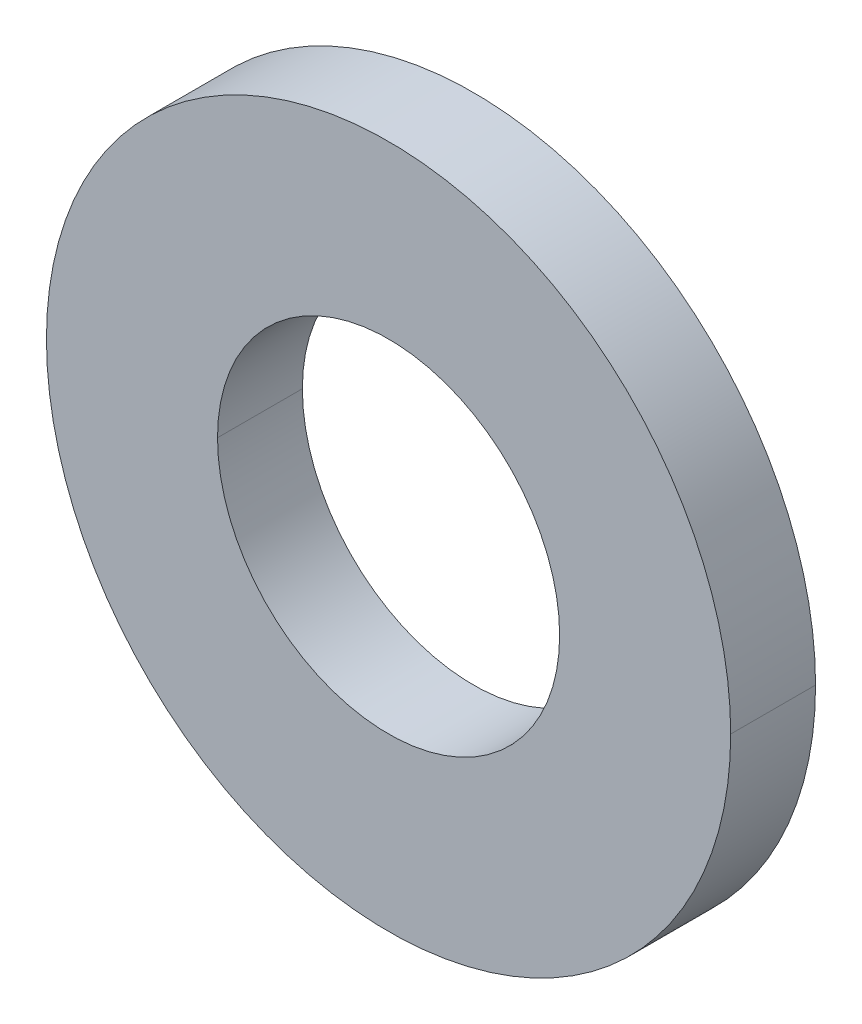
ISO-10303-21;
HEADER;
FILE_DESCRIPTION(('STEP AP214'),'2;1');
FILE_NAME('part.step','',(''),(''),'','','');
FILE_SCHEMA(('AUTOMOTIVE_DESIGN { 1 0 10303 214 1 1 1 1 }'));
ENDSEC;
DATA;
#1=APPLICATION_CONTEXT('core data for automotive mechanical design processes');
#2=APPLICATION_PROTOCOL_DEFINITION('international standard','automotive_design',2000,#1);
#3=PRODUCT_CONTEXT('',#1,'mechanical');
#4=PRODUCT('Part','Part','',(#3));
#5=PRODUCT_RELATED_PRODUCT_CATEGORY('part','',(#4));
#6=PRODUCT_DEFINITION_FORMATION('','',#4);
#7=PRODUCT_DEFINITION_CONTEXT('part definition',#1,'design');
#8=PRODUCT_DEFINITION('design','',#6,#7);
#9=PRODUCT_DEFINITION_SHAPE('','',#8);
#10=(LENGTH_UNIT() NAMED_UNIT(*) SI_UNIT(.MILLI.,.METRE.));
#11=(NAMED_UNIT(*) PLANE_ANGLE_UNIT() SI_UNIT($,.RADIAN.));
#12=(NAMED_UNIT(*) SI_UNIT($,.STERADIAN.) SOLID_ANGLE_UNIT());
#13=UNCERTAINTY_MEASURE_WITH_UNIT(LENGTH_MEASURE(1.E-05),#10,'distance_accuracy_value','');
#14=(GEOMETRIC_REPRESENTATION_CONTEXT(3) GLOBAL_UNCERTAINTY_ASSIGNED_CONTEXT((#13)) GLOBAL_UNIT_ASSIGNED_CONTEXT((#10,
#11,#12)) REPRESENTATION_CONTEXT('',''));
#15=CARTESIAN_POINT('',(0.,0.,0.));
#16=DIRECTION('',(0.,0.,1.));
#17=DIRECTION('',(1.,0.,0.));
#18=AXIS2_PLACEMENT_3D('',#15,#16,#17);
#19=CARTESIAN_POINT('',(0.,0.,0.7874));
#20=DIRECTION('',(0.,0.,-1.));
#21=DIRECTION('',(0.,1.,0.));
#22=AXIS2_PLACEMENT_3D('',#19,#20,#21);
#23=CYLINDRICAL_SURFACE('',#22,3.175);
#24=DIRECTION('',(0.,0.,-1.));
#25=VECTOR('',#24,1.);
#26=CARTESIAN_POINT('',(3.175,0.,0.7874));
#27=LINE('',#26,#25);
#28=CARTESIAN_POINT('',(3.175,0.,0.7874));
#29=VERTEX_POINT('',#28);
#30=CARTESIAN_POINT('',(3.175,0.,-0.7874));
#31=VERTEX_POINT('',#30);
#32=EDGE_CURVE('E11',#29,#31,#27,.T.);
#33=ORIENTED_EDGE('',*,*,#32,.T.);
#34=CARTESIAN_POINT('',(0.,0.,-0.7874));
#35=DIRECTION('',(0.,0.,1.));
#36=DIRECTION('',(1.,0.,0.));
#37=AXIS2_PLACEMENT_3D('',#34,#35,#36);
#38=CIRCLE('',#37,3.175);
#39=CARTESIAN_POINT('',(-3.175,0.,-0.7874));
#40=VERTEX_POINT('',#39);
#41=EDGE_CURVE('E25',#40,#31,#38,.T.);
#42=ORIENTED_EDGE('',*,*,#41,.F.);
#43=DIRECTION('',(0.,0.,-1.));
#44=VECTOR('',#43,1.);
#45=CARTESIAN_POINT('',(-3.175,0.,0.7874));
#46=LINE('',#45,#44);
#47=CARTESIAN_POINT('',(-3.175,0.,0.7874));
#48=VERTEX_POINT('',#47);
#49=EDGE_CURVE('E94',#48,#40,#46,.T.);
#50=ORIENTED_EDGE('',*,*,#49,.F.);
#51=CARTESIAN_POINT('',(0.,0.,0.7874));
#52=DIRECTION('',(0.,0.,1.));
#53=DIRECTION('',(1.,0.,0.));
#54=AXIS2_PLACEMENT_3D('',#51,#52,#53);
#55=CIRCLE('',#54,3.175);
#56=EDGE_CURVE('E90',#48,#29,#55,.T.);
#57=ORIENTED_EDGE('',*,*,#56,.T.);
#58=EDGE_LOOP('',(#33,#42,#50,#57));
#59=FACE_BOUND('',#58,.T.);
#60=ADVANCED_FACE('F17',(#59),#23,.F.);
#61=CARTESIAN_POINT('',(0.,0.,0.7874));
#62=DIRECTION('',(0.,0.,1.));
#63=DIRECTION('',(1.,0.,0.));
#64=AXIS2_PLACEMENT_3D('',#61,#62,#63);
#65=PLANE('',#64);
#66=ORIENTED_EDGE('',*,*,#56,.F.);
#67=CARTESIAN_POINT('',(0.,0.,0.7874));
#68=DIRECTION('',(0.,0.,1.));
#69=DIRECTION('',(1.,0.,0.));
#70=AXIS2_PLACEMENT_3D('',#67,#68,#69);
#71=CIRCLE('',#70,3.175);
#72=EDGE_CURVE('E85',#29,#48,#71,.T.);
#73=ORIENTED_EDGE('',*,*,#72,.F.);
#74=EDGE_LOOP('',(#66,#73));
#75=FACE_BOUND('',#74,.T.);
#76=CARTESIAN_POINT('',(0.,0.,0.7874));
#77=DIRECTION('',(0.,0.,1.));
#78=DIRECTION('',(1.,0.,0.));
#79=AXIS2_PLACEMENT_3D('',#76,#77,#78);
#80=CIRCLE('',#79,6.35);
#81=CARTESIAN_POINT('',(6.35,0.,0.7874));
#82=VERTEX_POINT('',#81);
#83=CARTESIAN_POINT('',(-6.35,0.,0.7874));
#84=VERTEX_POINT('',#83);
#85=EDGE_CURVE('E72',#82,#84,#80,.T.);
#86=ORIENTED_EDGE('',*,*,#85,.T.);
#87=CARTESIAN_POINT('',(0.,0.,0.7874));
#88=DIRECTION('',(0.,0.,1.));
#89=DIRECTION('',(1.,0.,0.));
#90=AXIS2_PLACEMENT_3D('',#87,#88,#89);
#91=CIRCLE('',#90,6.35);
#92=EDGE_CURVE('E73',#84,#82,#91,.T.);
#93=ORIENTED_EDGE('',*,*,#92,.T.);
#94=EDGE_LOOP('',(#86,#93));
#95=FACE_BOUND('',#94,.T.);
#96=ADVANCED_FACE('F116',(#75,#95),#65,.T.);
#97=CARTESIAN_POINT('',(0.,0.,0.7874));
#98=DIRECTION('',(0.,0.,-1.));
#99=DIRECTION('',(0.,1.,0.));
#100=AXIS2_PLACEMENT_3D('',#97,#98,#99);
#101=CYLINDRICAL_SURFACE('',#100,6.35);
#102=DIRECTION('',(0.,0.,-1.));
#103=VECTOR('',#102,1.);
#104=CARTESIAN_POINT('',(6.35,0.,0.7874));
#105=LINE('',#104,#103);
#106=CARTESIAN_POINT('',(6.35,0.,-0.7874));
#107=VERTEX_POINT('',#106);
#108=EDGE_CURVE('E59',#82,#107,#105,.T.);
#109=ORIENTED_EDGE('',*,*,#108,.F.);
#110=ORIENTED_EDGE('',*,*,#92,.F.);
#111=DIRECTION('',(0.,0.,-1.));
#112=VECTOR('',#111,1.);
#113=CARTESIAN_POINT('',(-6.35,0.,0.7874));
#114=LINE('',#113,#112);
#115=CARTESIAN_POINT('',(-6.35,0.,-0.7874));
#116=VERTEX_POINT('',#115);
#117=EDGE_CURVE('E61',#84,#116,#114,.T.);
#118=ORIENTED_EDGE('',*,*,#117,.T.);
#119=CARTESIAN_POINT('',(0.,0.,-0.7874));
#120=DIRECTION('',(0.,0.,1.));
#121=DIRECTION('',(1.,0.,0.));
#122=AXIS2_PLACEMENT_3D('',#119,#120,#121);
#123=CIRCLE('',#122,6.35);
#124=EDGE_CURVE('E54',#116,#107,#123,.T.);
#125=ORIENTED_EDGE('',*,*,#124,.T.);
#126=EDGE_LOOP('',(#109,#110,#118,#125));
#127=FACE_BOUND('',#126,.T.);
#128=ADVANCED_FACE('F56',(#127),#101,.T.);
#129=CARTESIAN_POINT('',(0.,0.,-0.7874));
#130=DIRECTION('',(0.,0.,1.));
#131=DIRECTION('',(1.,0.,0.));
#132=AXIS2_PLACEMENT_3D('',#129,#130,#131);
#133=PLANE('',#132);
#134=CARTESIAN_POINT('',(0.,0.,-0.7874));
#135=DIRECTION('',(0.,0.,1.));
#136=DIRECTION('',(1.,0.,0.));
#137=AXIS2_PLACEMENT_3D('',#134,#135,#136);
#138=CIRCLE('',#137,3.175);
#139=EDGE_CURVE('E64',#31,#40,#138,.T.);
#140=ORIENTED_EDGE('',*,*,#139,.T.);
#141=ORIENTED_EDGE('',*,*,#41,.T.);
#142=EDGE_LOOP('',(#140,#141));
#143=FACE_BOUND('',#142,.T.);
#144=ORIENTED_EDGE('',*,*,#124,.F.);
#145=CARTESIAN_POINT('',(0.,0.,-0.7874));
#146=DIRECTION('',(0.,0.,1.));
#147=DIRECTION('',(1.,0.,0.));
#148=AXIS2_PLACEMENT_3D('',#145,#146,#147);
#149=CIRCLE('',#148,6.35);
#150=EDGE_CURVE('E66',#107,#116,#149,.T.);
#151=ORIENTED_EDGE('',*,*,#150,.F.);
#152=EDGE_LOOP('',(#144,#151));
#153=FACE_BOUND('',#152,.T.);
#154=ADVANCED_FACE('F67',(#143,#153),#133,.F.);
#155=CARTESIAN_POINT('',(0.,0.,0.7874));
#156=DIRECTION('',(0.,0.,-1.));
#157=DIRECTION('',(0.,-1.,0.));
#158=AXIS2_PLACEMENT_3D('',#155,#156,#157);
#159=CYLINDRICAL_SURFACE('',#158,6.35);
#160=ORIENTED_EDGE('',*,*,#108,.T.);
#161=ORIENTED_EDGE('',*,*,#150,.T.);
#162=ORIENTED_EDGE('',*,*,#117,.F.);
#163=ORIENTED_EDGE('',*,*,#85,.F.);
#164=EDGE_LOOP('',(#160,#161,#162,#163));
#165=FACE_BOUND('',#164,.T.);
#166=ADVANCED_FACE('F71',(#165),#159,.T.);
#167=CARTESIAN_POINT('',(0.,0.,0.7874));
#168=DIRECTION('',(0.,0.,-1.));
#169=DIRECTION('',(0.,-1.,0.));
#170=AXIS2_PLACEMENT_3D('',#167,#168,#169);
#171=CYLINDRICAL_SURFACE('',#170,3.175);
#172=ORIENTED_EDGE('',*,*,#32,.F.);
#173=ORIENTED_EDGE('',*,*,#72,.T.);
#174=ORIENTED_EDGE('',*,*,#49,.T.);
#175=ORIENTED_EDGE('',*,*,#139,.F.);
#176=EDGE_LOOP('',(#172,#173,#174,#175));
#177=FACE_BOUND('',#176,.T.);
#178=ADVANCED_FACE('F112',(#177),#171,.F.);
#179=CLOSED_SHELL('',(#60,#96,#128,#154,#166,#178));
#180=MANIFOLD_SOLID_BREP('B1',#179);
#181=ADVANCED_BREP_SHAPE_REPRESENTATION('',(#18,#180),#14);
#182=SHAPE_DEFINITION_REPRESENTATION(#9,#181);
ENDSEC;
END-ISO-10303-21;
